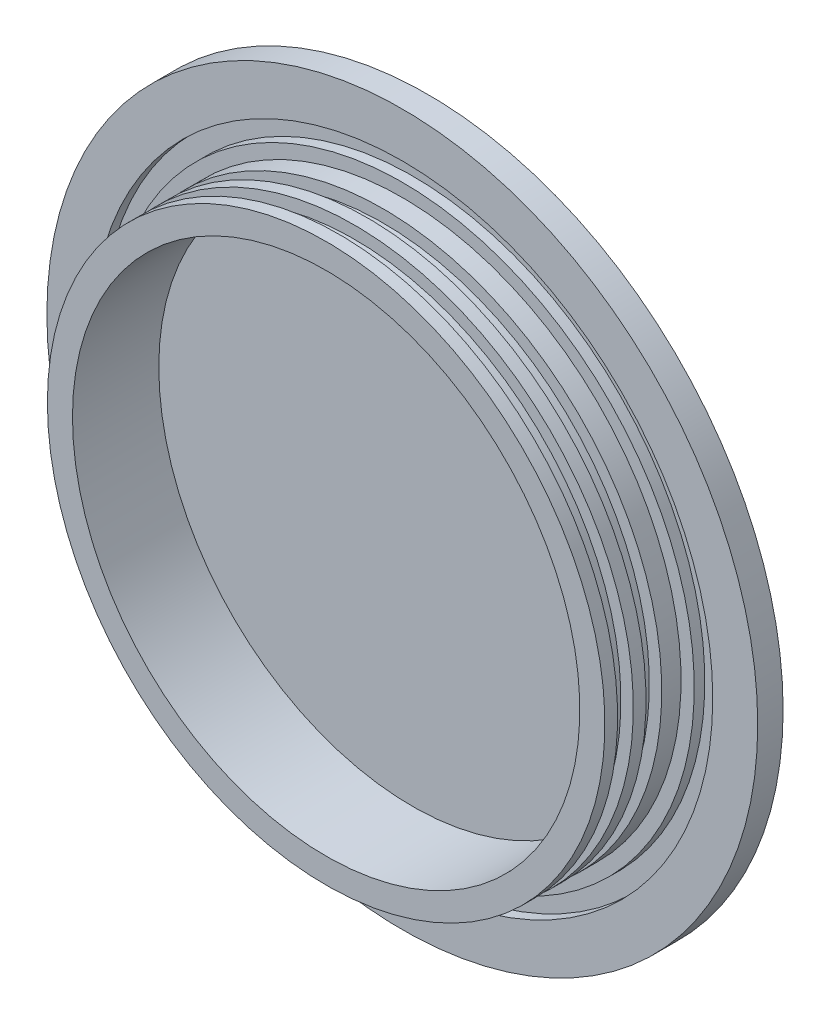
ISO-10303-21;
HEADER;
FILE_DESCRIPTION(('STEP AP214'),'2;1');
FILE_NAME('part.step','',(''),(''),'','','');
FILE_SCHEMA(('AUTOMOTIVE_DESIGN { 1 0 10303 214 1 1 1 1 }'));
ENDSEC;
DATA;
#1=APPLICATION_CONTEXT('core data for automotive mechanical design processes');
#2=APPLICATION_PROTOCOL_DEFINITION('international standard','automotive_design',2000,#1);
#3=PRODUCT_CONTEXT('',#1,'mechanical');
#4=PRODUCT('Part','Part','',(#3));
#5=PRODUCT_RELATED_PRODUCT_CATEGORY('part','',(#4));
#6=PRODUCT_DEFINITION_FORMATION('','',#4);
#7=PRODUCT_DEFINITION_CONTEXT('part definition',#1,'design');
#8=PRODUCT_DEFINITION('design','',#6,#7);
#9=PRODUCT_DEFINITION_SHAPE('','',#8);
#10=(LENGTH_UNIT() NAMED_UNIT(*) SI_UNIT(.MILLI.,.METRE.));
#11=(NAMED_UNIT(*) PLANE_ANGLE_UNIT() SI_UNIT($,.RADIAN.));
#12=(NAMED_UNIT(*) SI_UNIT($,.STERADIAN.) SOLID_ANGLE_UNIT());
#13=UNCERTAINTY_MEASURE_WITH_UNIT(LENGTH_MEASURE(1.E-05),#10,'distance_accuracy_value','');
#14=(GEOMETRIC_REPRESENTATION_CONTEXT(3) GLOBAL_UNCERTAINTY_ASSIGNED_CONTEXT((#13)) GLOBAL_UNIT_ASSIGNED_CONTEXT((#10,
#11,#12)) REPRESENTATION_CONTEXT('',''));
#15=CARTESIAN_POINT('',(0.,0.,0.));
#16=DIRECTION('',(0.,0.,1.));
#17=DIRECTION('',(1.,0.,0.));
#18=AXIS2_PLACEMENT_3D('',#15,#16,#17);
#19=CARTESIAN_POINT('',(0.,0.,0.));
#20=DIRECTION('',(0.,0.,1.));
#21=DIRECTION('',(1.,0.,0.));
#22=AXIS2_PLACEMENT_3D('',#19,#20,#21);
#23=PLANE('',#22);
#24=CARTESIAN_POINT('',(0.,0.,0.));
#25=DIRECTION('',(0.,0.,-1.));
#26=DIRECTION('',(-1.,0.,0.));
#27=AXIS2_PLACEMENT_3D('',#24,#25,#26);
#28=CIRCLE('',#27,88.9);
#29=CARTESIAN_POINT('',(-88.9,0.,0.));
#30=VERTEX_POINT('',#29);
#31=EDGE_CURVE('E12',#30,#30,#28,.T.);
#32=ORIENTED_EDGE('',*,*,#31,.T.);
#33=EDGE_LOOP('',(#32));
#34=FACE_BOUND('',#33,.T.);
#35=ADVANCED_FACE('F41',(#34),#23,.F.);
#36=CARTESIAN_POINT('',(0.,0.,0.));
#37=DIRECTION('',(0.,0.,-1.));
#38=DIRECTION('',(-1.,0.,0.));
#39=AXIS2_PLACEMENT_3D('',#36,#37,#38);
#40=CYLINDRICAL_SURFACE('',#39,88.9);
#41=ORIENTED_EDGE('',*,*,#31,.F.);
#42=EDGE_LOOP('',(#41));
#43=FACE_BOUND('',#42,.T.);
#44=CARTESIAN_POINT('',(0.,0.,6.35));
#45=DIRECTION('',(0.,0.,-1.));
#46=DIRECTION('',(-1.,0.,0.));
#47=AXIS2_PLACEMENT_3D('',#44,#45,#46);
#48=CIRCLE('',#47,88.9);
#49=CARTESIAN_POINT('',(-88.9,0.,6.35));
#50=VERTEX_POINT('',#49);
#51=EDGE_CURVE('E47',#50,#50,#48,.T.);
#52=ORIENTED_EDGE('',*,*,#51,.T.);
#53=EDGE_LOOP('',(#52));
#54=FACE_BOUND('',#53,.T.);
#55=ADVANCED_FACE('F115',(#43,#54),#40,.T.);
#56=CARTESIAN_POINT('',(77.6478,0.,6.35));
#57=DIRECTION('',(0.,0.,-1.));
#58=DIRECTION('',(-1.,0.,0.));
#59=AXIS2_PLACEMENT_3D('',#56,#57,#58);
#60=PLANE('',#59);
#61=ORIENTED_EDGE('',*,*,#51,.F.);
#62=EDGE_LOOP('',(#61));
#63=FACE_BOUND('',#62,.T.);
#64=CARTESIAN_POINT('',(0.,0.,6.35));
#65=DIRECTION('',(0.,0.,-1.));
#66=DIRECTION('',(-1.,0.,0.));
#67=AXIS2_PLACEMENT_3D('',#64,#65,#66);
#68=CIRCLE('',#67,77.6478);
#69=CARTESIAN_POINT('',(-77.6478,0.,6.35));
#70=VERTEX_POINT('',#69);
#71=EDGE_CURVE('E51',#70,#70,#68,.T.);
#72=ORIENTED_EDGE('',*,*,#71,.T.);
#73=EDGE_LOOP('',(#72));
#74=FACE_BOUND('',#73,.T.);
#75=ADVANCED_FACE('F119',(#63,#74),#60,.F.);
#76=CARTESIAN_POINT('',(0.,0.,0.));
#77=DIRECTION('',(0.,0.,-1.));
#78=DIRECTION('',(-1.,0.,0.));
#79=AXIS2_PLACEMENT_3D('',#76,#77,#78);
#80=CYLINDRICAL_SURFACE('',#79,77.6478);
#81=ORIENTED_EDGE('',*,*,#71,.F.);
#82=EDGE_LOOP('',(#81));
#83=FACE_BOUND('',#82,.T.);
#84=CARTESIAN_POINT('',(0.,0.,3.7084));
#85=DIRECTION('',(0.,0.,-1.));
#86=DIRECTION('',(-1.,0.,0.));
#87=AXIS2_PLACEMENT_3D('',#84,#85,#86);
#88=CIRCLE('',#87,77.6478);
#89=CARTESIAN_POINT('',(-77.6478,0.,3.7084));
#90=VERTEX_POINT('',#89);
#91=EDGE_CURVE('E55',#90,#90,#88,.T.);
#92=ORIENTED_EDGE('',*,*,#91,.T.);
#93=EDGE_LOOP('',(#92));
#94=FACE_BOUND('',#93,.T.);
#95=ADVANCED_FACE('F124',(#83,#94),#80,.F.);
#96=CARTESIAN_POINT('',(73.025,0.,3.7084));
#97=DIRECTION('',(0.,0.,-1.));
#98=DIRECTION('',(-1.,0.,0.));
#99=AXIS2_PLACEMENT_3D('',#96,#97,#98);
#100=PLANE('',#99);
#101=ORIENTED_EDGE('',*,*,#91,.F.);
#102=EDGE_LOOP('',(#101));
#103=FACE_BOUND('',#102,.T.);
#104=CARTESIAN_POINT('',(0.,0.,3.7084));
#105=DIRECTION('',(0.,0.,-1.));
#106=DIRECTION('',(-1.,0.,0.));
#107=AXIS2_PLACEMENT_3D('',#104,#105,#106);
#108=CIRCLE('',#107,73.025);
#109=CARTESIAN_POINT('',(-73.025,0.,3.7084));
#110=VERTEX_POINT('',#109);
#111=EDGE_CURVE('E60',#110,#110,#108,.T.);
#112=ORIENTED_EDGE('',*,*,#111,.T.);
#113=EDGE_LOOP('',(#112));
#114=FACE_BOUND('',#113,.T.);
#115=ADVANCED_FACE('F130',(#103,#114),#100,.F.);
#116=CARTESIAN_POINT('',(0.,0.,0.));
#117=DIRECTION('',(0.,0.,-1.));
#118=DIRECTION('',(-1.,0.,0.));
#119=AXIS2_PLACEMENT_3D('',#116,#117,#118);
#120=CYLINDRICAL_SURFACE('',#119,73.025);
#121=ORIENTED_EDGE('',*,*,#111,.F.);
#122=EDGE_LOOP('',(#121));
#123=FACE_BOUND('',#122,.T.);
#124=CARTESIAN_POINT('',(0.,0.,6.35));
#125=DIRECTION('',(0.,0.,-1.));
#126=DIRECTION('',(-1.,0.,0.));
#127=AXIS2_PLACEMENT_3D('',#124,#125,#126);
#128=CIRCLE('',#127,73.025);
#129=CARTESIAN_POINT('',(-73.025,0.,6.35));
#130=VERTEX_POINT('',#129);
#131=EDGE_CURVE('E63',#130,#130,#128,.T.);
#132=ORIENTED_EDGE('',*,*,#131,.T.);
#133=EDGE_LOOP('',(#132));
#134=FACE_BOUND('',#133,.T.);
#135=ADVANCED_FACE('F134',(#123,#134),#120,.T.);
#136=CARTESIAN_POINT('',(73.025,0.,6.35));
#137=DIRECTION('',(0.,0.,-1.));
#138=DIRECTION('',(-1.,0.,0.));
#139=AXIS2_PLACEMENT_3D('',#136,#137,#138);
#140=PLANE('',#139);
#141=ORIENTED_EDGE('',*,*,#131,.F.);
#142=EDGE_LOOP('',(#141));
#143=FACE_BOUND('',#142,.T.);
#144=CARTESIAN_POINT('',(0.,0.,6.35));
#145=DIRECTION('',(0.,0.,-1.));
#146=DIRECTION('',(-1.,0.,0.));
#147=AXIS2_PLACEMENT_3D('',#144,#145,#146);
#148=CIRCLE('',#147,69.723);
#149=CARTESIAN_POINT('',(-69.723,0.,6.35));
#150=VERTEX_POINT('',#149);
#151=EDGE_CURVE('E66',#150,#150,#148,.T.);
#152=ORIENTED_EDGE('',*,*,#151,.T.);
#153=EDGE_LOOP('',(#152));
#154=FACE_BOUND('',#153,.T.);
#155=ADVANCED_FACE('F138',(#143,#154),#140,.F.);
#156=CARTESIAN_POINT('',(0.,0.,0.));
#157=DIRECTION('',(0.,0.,-1.));
#158=DIRECTION('',(-1.,0.,0.));
#159=AXIS2_PLACEMENT_3D('',#156,#157,#158);
#160=CYLINDRICAL_SURFACE('',#159,69.723);
#161=ORIENTED_EDGE('',*,*,#151,.F.);
#162=EDGE_LOOP('',(#161));
#163=FACE_BOUND('',#162,.T.);
#164=CARTESIAN_POINT('',(0.,0.,11.176));
#165=DIRECTION('',(0.,0.,-1.));
#166=DIRECTION('',(-1.,0.,0.));
#167=AXIS2_PLACEMENT_3D('',#164,#165,#166);
#168=CIRCLE('',#167,69.723);
#169=CARTESIAN_POINT('',(-69.723,0.,11.176));
#170=VERTEX_POINT('',#169);
#171=EDGE_CURVE('E69',#170,#170,#168,.T.);
#172=ORIENTED_EDGE('',*,*,#171,.T.);
#173=EDGE_LOOP('',(#172));
#174=FACE_BOUND('',#173,.T.);
#175=ADVANCED_FACE('F142',(#163,#174),#160,.T.);
#176=CARTESIAN_POINT('',(66.6242,0.,11.176));
#177=DIRECTION('',(0.,0.,-1.));
#178=DIRECTION('',(-1.,0.,0.));
#179=AXIS2_PLACEMENT_3D('',#176,#177,#178);
#180=PLANE('',#179);
#181=ORIENTED_EDGE('',*,*,#171,.F.);
#182=EDGE_LOOP('',(#181));
#183=FACE_BOUND('',#182,.T.);
#184=CARTESIAN_POINT('',(0.,0.,11.176));
#185=DIRECTION('',(0.,0.,-1.));
#186=DIRECTION('',(-1.,0.,0.));
#187=AXIS2_PLACEMENT_3D('',#184,#185,#186);
#188=CIRCLE('',#187,66.6242);
#189=CARTESIAN_POINT('',(-66.6242,0.,11.176));
#190=VERTEX_POINT('',#189);
#191=EDGE_CURVE('E72',#190,#190,#188,.T.);
#192=ORIENTED_EDGE('',*,*,#191,.T.);
#193=EDGE_LOOP('',(#192));
#194=FACE_BOUND('',#193,.T.);
#195=ADVANCED_FACE('F146',(#183,#194),#180,.F.);
#196=CARTESIAN_POINT('',(0.,0.,0.));
#197=DIRECTION('',(0.,0.,-1.));
#198=DIRECTION('',(-1.,0.,0.));
#199=AXIS2_PLACEMENT_3D('',#196,#197,#198);
#200=CYLINDRICAL_SURFACE('',#199,66.6242);
#201=ORIENTED_EDGE('',*,*,#191,.F.);
#202=EDGE_LOOP('',(#201));
#203=FACE_BOUND('',#202,.T.);
#204=CARTESIAN_POINT('',(0.,0.,15.113));
#205=DIRECTION('',(0.,0.,-1.));
#206=DIRECTION('',(-1.,0.,0.));
#207=AXIS2_PLACEMENT_3D('',#204,#205,#206);
#208=CIRCLE('',#207,66.6242);
#209=CARTESIAN_POINT('',(-66.6242,0.,15.113));
#210=VERTEX_POINT('',#209);
#211=EDGE_CURVE('E75',#210,#210,#208,.T.);
#212=ORIENTED_EDGE('',*,*,#211,.T.);
#213=EDGE_LOOP('',(#212));
#214=FACE_BOUND('',#213,.T.);
#215=ADVANCED_FACE('F150',(#203,#214),#200,.T.);
#216=CARTESIAN_POINT('',(69.723,0.,15.113));
#217=DIRECTION('',(0.,0.,1.));
#218=DIRECTION('',(1.,0.,0.));
#219=AXIS2_PLACEMENT_3D('',#216,#217,#218);
#220=PLANE('',#219);
#221=ORIENTED_EDGE('',*,*,#211,.F.);
#222=EDGE_LOOP('',(#221));
#223=FACE_BOUND('',#222,.T.);
#224=CARTESIAN_POINT('',(0.,0.,15.113));
#225=DIRECTION('',(0.,0.,-1.));
#226=DIRECTION('',(-1.,0.,0.));
#227=AXIS2_PLACEMENT_3D('',#224,#225,#226);
#228=CIRCLE('',#227,69.723);
#229=CARTESIAN_POINT('',(-69.723,0.,15.113));
#230=VERTEX_POINT('',#229);
#231=EDGE_CURVE('E78',#230,#230,#228,.T.);
#232=ORIENTED_EDGE('',*,*,#231,.T.);
#233=EDGE_LOOP('',(#232));
#234=FACE_BOUND('',#233,.T.);
#235=ADVANCED_FACE('F154',(#223,#234),#220,.F.);
#236=CARTESIAN_POINT('',(0.,0.,0.));
#237=DIRECTION('',(0.,0.,-1.));
#238=DIRECTION('',(-1.,0.,0.));
#239=AXIS2_PLACEMENT_3D('',#236,#237,#238);
#240=CYLINDRICAL_SURFACE('',#239,69.723);
#241=ORIENTED_EDGE('',*,*,#231,.F.);
#242=EDGE_LOOP('',(#241));
#243=FACE_BOUND('',#242,.T.);
#244=CARTESIAN_POINT('',(0.,0.,18.288));
#245=DIRECTION('',(0.,0.,-1.));
#246=DIRECTION('',(-1.,0.,0.));
#247=AXIS2_PLACEMENT_3D('',#244,#245,#246);
#248=CIRCLE('',#247,69.723);
#249=CARTESIAN_POINT('',(-69.723,0.,18.288));
#250=VERTEX_POINT('',#249);
#251=EDGE_CURVE('E81',#250,#250,#248,.T.);
#252=ORIENTED_EDGE('',*,*,#251,.T.);
#253=EDGE_LOOP('',(#252));
#254=FACE_BOUND('',#253,.T.);
#255=ADVANCED_FACE('F158',(#243,#254),#240,.T.);
#256=CARTESIAN_POINT('',(66.6242,0.,18.288));
#257=DIRECTION('',(0.,0.,-1.));
#258=DIRECTION('',(-1.,0.,0.));
#259=AXIS2_PLACEMENT_3D('',#256,#257,#258);
#260=PLANE('',#259);
#261=ORIENTED_EDGE('',*,*,#251,.F.);
#262=EDGE_LOOP('',(#261));
#263=FACE_BOUND('',#262,.T.);
#264=CARTESIAN_POINT('',(0.,0.,18.288));
#265=DIRECTION('',(0.,0.,-1.));
#266=DIRECTION('',(-1.,0.,0.));
#267=AXIS2_PLACEMENT_3D('',#264,#265,#266);
#268=CIRCLE('',#267,66.6242);
#269=CARTESIAN_POINT('',(-66.6242,0.,18.288));
#270=VERTEX_POINT('',#269);
#271=EDGE_CURVE('E84',#270,#270,#268,.T.);
#272=ORIENTED_EDGE('',*,*,#271,.T.);
#273=EDGE_LOOP('',(#272));
#274=FACE_BOUND('',#273,.T.);
#275=ADVANCED_FACE('F162',(#263,#274),#260,.F.);
#276=CARTESIAN_POINT('',(0.,0.,0.));
#277=DIRECTION('',(0.,0.,-1.));
#278=DIRECTION('',(-1.,0.,0.));
#279=AXIS2_PLACEMENT_3D('',#276,#277,#278);
#280=CYLINDRICAL_SURFACE('',#279,66.6242);
#281=ORIENTED_EDGE('',*,*,#271,.F.);
#282=EDGE_LOOP('',(#281));
#283=FACE_BOUND('',#282,.T.);
#284=CARTESIAN_POINT('',(0.,0.,22.225));
#285=DIRECTION('',(0.,0.,-1.));
#286=DIRECTION('',(-1.,0.,0.));
#287=AXIS2_PLACEMENT_3D('',#284,#285,#286);
#288=CIRCLE('',#287,66.6242);
#289=CARTESIAN_POINT('',(-66.6242,0.,22.225));
#290=VERTEX_POINT('',#289);
#291=EDGE_CURVE('E87',#290,#290,#288,.T.);
#292=ORIENTED_EDGE('',*,*,#291,.T.);
#293=EDGE_LOOP('',(#292));
#294=FACE_BOUND('',#293,.T.);
#295=ADVANCED_FACE('F166',(#283,#294),#280,.T.);
#296=CARTESIAN_POINT('',(69.723,0.,22.225));
#297=DIRECTION('',(0.,0.,1.));
#298=DIRECTION('',(1.,0.,0.));
#299=AXIS2_PLACEMENT_3D('',#296,#297,#298);
#300=PLANE('',#299);
#301=ORIENTED_EDGE('',*,*,#291,.F.);
#302=EDGE_LOOP('',(#301));
#303=FACE_BOUND('',#302,.T.);
#304=CARTESIAN_POINT('',(0.,0.,22.225));
#305=DIRECTION('',(0.,0.,-1.));
#306=DIRECTION('',(-1.,0.,0.));
#307=AXIS2_PLACEMENT_3D('',#304,#305,#306);
#308=CIRCLE('',#307,69.723);
#309=CARTESIAN_POINT('',(-69.723,0.,22.225));
#310=VERTEX_POINT('',#309);
#311=EDGE_CURVE('E90',#310,#310,#308,.T.);
#312=ORIENTED_EDGE('',*,*,#311,.T.);
#313=EDGE_LOOP('',(#312));
#314=FACE_BOUND('',#313,.T.);
#315=ADVANCED_FACE('F170',(#303,#314),#300,.F.);
#316=CARTESIAN_POINT('',(0.,0.,0.));
#317=DIRECTION('',(0.,0.,-1.));
#318=DIRECTION('',(-1.,0.,0.));
#319=AXIS2_PLACEMENT_3D('',#316,#317,#318);
#320=CYLINDRICAL_SURFACE('',#319,69.723);
#321=ORIENTED_EDGE('',*,*,#311,.F.);
#322=EDGE_LOOP('',(#321));
#323=FACE_BOUND('',#322,.T.);
#324=CARTESIAN_POINT('',(0.,0.,25.4));
#325=DIRECTION('',(0.,0.,-1.));
#326=DIRECTION('',(-1.,0.,0.));
#327=AXIS2_PLACEMENT_3D('',#324,#325,#326);
#328=CIRCLE('',#327,69.723);
#329=CARTESIAN_POINT('',(-69.723,0.,25.4));
#330=VERTEX_POINT('',#329);
#331=EDGE_CURVE('E93',#330,#330,#328,.T.);
#332=ORIENTED_EDGE('',*,*,#331,.T.);
#333=EDGE_LOOP('',(#332));
#334=FACE_BOUND('',#333,.T.);
#335=ADVANCED_FACE('F174',(#323,#334),#320,.T.);
#336=CARTESIAN_POINT('',(63.4492,0.,25.4));
#337=DIRECTION('',(0.,0.,-1.));
#338=DIRECTION('',(-1.,0.,0.));
#339=AXIS2_PLACEMENT_3D('',#336,#337,#338);
#340=PLANE('',#339);
#341=ORIENTED_EDGE('',*,*,#331,.F.);
#342=EDGE_LOOP('',(#341));
#343=FACE_BOUND('',#342,.T.);
#344=CARTESIAN_POINT('',(0.,0.,25.4));
#345=DIRECTION('',(0.,0.,-1.));
#346=DIRECTION('',(-1.,0.,0.));
#347=AXIS2_PLACEMENT_3D('',#344,#345,#346);
#348=CIRCLE('',#347,63.4492);
#349=CARTESIAN_POINT('',(-63.4492,0.,25.4));
#350=VERTEX_POINT('',#349);
#351=EDGE_CURVE('E96',#350,#350,#348,.T.);
#352=ORIENTED_EDGE('',*,*,#351,.T.);
#353=EDGE_LOOP('',(#352));
#354=FACE_BOUND('',#353,.T.);
#355=ADVANCED_FACE('F111',(#343,#354),#340,.F.);
#356=CARTESIAN_POINT('',(0.,0.,0.));
#357=DIRECTION('',(0.,0.,-1.));
#358=DIRECTION('',(-1.,0.,0.));
#359=AXIS2_PLACEMENT_3D('',#356,#357,#358);
#360=CYLINDRICAL_SURFACE('',#359,63.4492);
#361=ORIENTED_EDGE('',*,*,#351,.F.);
#362=EDGE_LOOP('',(#361));
#363=FACE_BOUND('',#362,.T.);
#364=CARTESIAN_POINT('',(0.,0.,3.81));
#365=DIRECTION('',(0.,0.,-1.));
#366=DIRECTION('',(-1.,0.,0.));
#367=AXIS2_PLACEMENT_3D('',#364,#365,#366);
#368=CIRCLE('',#367,63.4492);
#369=CARTESIAN_POINT('',(-63.4492,0.,3.81));
#370=VERTEX_POINT('',#369);
#371=EDGE_CURVE('E99',#370,#370,#368,.T.);
#372=ORIENTED_EDGE('',*,*,#371,.T.);
#373=EDGE_LOOP('',(#372));
#374=FACE_BOUND('',#373,.T.);
#375=ADVANCED_FACE('F103',(#363,#374),#360,.F.);
#376=CARTESIAN_POINT('',(63.4492,0.,3.81));
#377=DIRECTION('',(0.,0.,-1.));
#378=DIRECTION('',(-1.,0.,0.));
#379=AXIS2_PLACEMENT_3D('',#376,#377,#378);
#380=PLANE('',#379);
#381=ORIENTED_EDGE('',*,*,#371,.F.);
#382=EDGE_LOOP('',(#381));
#383=FACE_BOUND('',#382,.T.);
#384=ADVANCED_FACE('F105',(#383),#380,.F.);
#385=CLOSED_SHELL('',(#35,#55,#75,#95,#115,#135,#155,#175,#195,#215,#235,#255,#275,#295,#315,
#335,#355,#375,#384));
#386=MANIFOLD_SOLID_BREP('B2',#385);
#387=ADVANCED_BREP_SHAPE_REPRESENTATION('',(#18,#386),#14);
#388=SHAPE_DEFINITION_REPRESENTATION(#9,#387);
ENDSEC;
END-ISO-10303-21;
